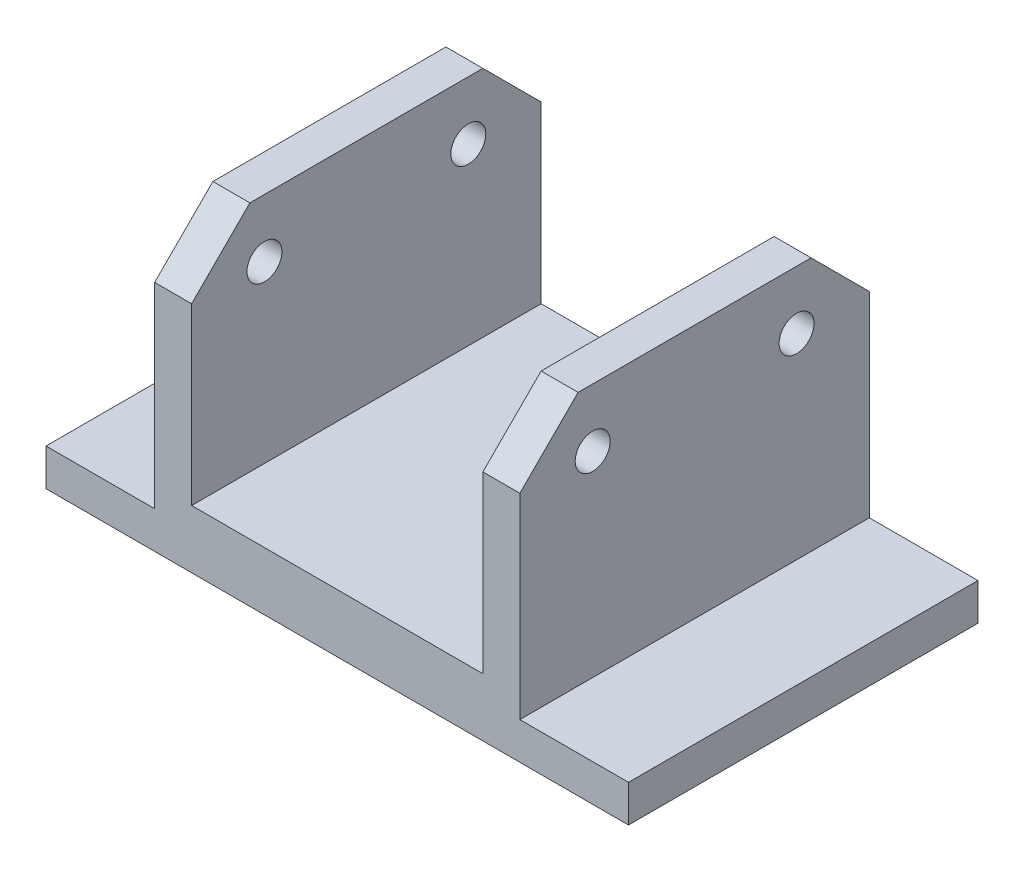
ISO-10303-21;
HEADER;
FILE_DESCRIPTION(('STEP AP214'),'2;1');
FILE_NAME('part.step','',(''),(''),'','','');
FILE_SCHEMA(('AUTOMOTIVE_DESIGN { 1 0 10303 214 1 1 1 1 }'));
ENDSEC;
DATA;
#1=APPLICATION_CONTEXT('core data for automotive mechanical design processes');
#2=APPLICATION_PROTOCOL_DEFINITION('international standard','automotive_design',2000,#1);
#3=PRODUCT_CONTEXT('',#1,'mechanical');
#4=PRODUCT('Part','Part','',(#3));
#5=PRODUCT_RELATED_PRODUCT_CATEGORY('part','',(#4));
#6=PRODUCT_DEFINITION_FORMATION('','',#4);
#7=PRODUCT_DEFINITION_CONTEXT('part definition',#1,'design');
#8=PRODUCT_DEFINITION('design','',#6,#7);
#9=PRODUCT_DEFINITION_SHAPE('','',#8);
#10=(LENGTH_UNIT() NAMED_UNIT(*) SI_UNIT(.MILLI.,.METRE.));
#11=(NAMED_UNIT(*) PLANE_ANGLE_UNIT() SI_UNIT($,.RADIAN.));
#12=(NAMED_UNIT(*) SI_UNIT($,.STERADIAN.) SOLID_ANGLE_UNIT());
#13=UNCERTAINTY_MEASURE_WITH_UNIT(LENGTH_MEASURE(1.E-05),#10,'distance_accuracy_value','');
#14=(GEOMETRIC_REPRESENTATION_CONTEXT(3) GLOBAL_UNCERTAINTY_ASSIGNED_CONTEXT((#13)) GLOBAL_UNIT_ASSIGNED_CONTEXT((#10,
#11,#12)) REPRESENTATION_CONTEXT('',''));
#15=CARTESIAN_POINT('',(0.,0.,0.));
#16=DIRECTION('',(0.,0.,1.));
#17=DIRECTION('',(1.,0.,0.));
#18=AXIS2_PLACEMENT_3D('',#15,#16,#17);
#19=CARTESIAN_POINT('',(100.,0.,60.));
#20=DIRECTION('',(-1.,0.,0.));
#21=DIRECTION('',(0.,0.,1.));
#22=AXIS2_PLACEMENT_3D('',#19,#20,#21);
#23=PLANE('',#22);
#24=DIRECTION('',(0.,1.,0.));
#25=VECTOR('',#24,1.);
#26=CARTESIAN_POINT('',(100.,0.,-60.));
#27=LINE('',#26,#25);
#28=CARTESIAN_POINT('',(100.,0.,-60.));
#29=VERTEX_POINT('',#28);
#30=CARTESIAN_POINT('',(100.,12.7,-60.));
#31=VERTEX_POINT('',#30);
#32=EDGE_CURVE('E172',#29,#31,#27,.T.);
#33=ORIENTED_EDGE('',*,*,#32,.T.);
#34=DIRECTION('',(0.,0.,-1.));
#35=VECTOR('',#34,1.);
#36=CARTESIAN_POINT('',(100.,12.7,60.));
#37=LINE('',#36,#35);
#38=CARTESIAN_POINT('',(100.,12.7,60.));
#39=VERTEX_POINT('',#38);
#40=EDGE_CURVE('E152',#39,#31,#37,.T.);
#41=ORIENTED_EDGE('',*,*,#40,.F.);
#42=DIRECTION('',(0.,1.,0.));
#43=VECTOR('',#42,1.);
#44=CARTESIAN_POINT('',(100.,0.,60.));
#45=LINE('',#44,#43);
#46=CARTESIAN_POINT('',(100.,0.,60.));
#47=VERTEX_POINT('',#46);
#48=EDGE_CURVE('E160',#47,#39,#45,.T.);
#49=ORIENTED_EDGE('',*,*,#48,.F.);
#50=DIRECTION('',(0.,0.,-1.));
#51=VECTOR('',#50,1.);
#52=CARTESIAN_POINT('',(100.,0.,60.));
#53=LINE('',#52,#51);
#54=EDGE_CURVE('E245',#47,#29,#53,.T.);
#55=ORIENTED_EDGE('',*,*,#54,.T.);
#56=EDGE_LOOP('',(#33,#41,#49,#55));
#57=FACE_BOUND('',#56,.T.);
#58=ADVANCED_FACE('F33',(#57),#23,.F.);
#59=CARTESIAN_POINT('',(100.,12.7,60.));
#60=DIRECTION('',(0.,-1.,0.));
#61=DIRECTION('',(1.,0.,0.));
#62=AXIS2_PLACEMENT_3D('',#59,#60,#61);
#63=PLANE('',#62);
#64=DIRECTION('',(-1.,0.,0.));
#65=VECTOR('',#64,1.);
#66=CARTESIAN_POINT('',(100.,12.7,-60.));
#67=LINE('',#66,#65);
#68=CARTESIAN_POINT('',(62.7,12.7,-60.));
#69=VERTEX_POINT('',#68);
#70=EDGE_CURVE('E247',#31,#69,#67,.T.);
#71=ORIENTED_EDGE('',*,*,#70,.T.);
#72=DIRECTION('',(0.,0.,-1.));
#73=VECTOR('',#72,1.);
#74=CARTESIAN_POINT('',(62.7,12.7,60.));
#75=LINE('',#74,#73);
#76=CARTESIAN_POINT('',(62.7,12.7,60.));
#77=VERTEX_POINT('',#76);
#78=EDGE_CURVE('E155',#77,#69,#75,.T.);
#79=ORIENTED_EDGE('',*,*,#78,.F.);
#80=DIRECTION('',(-1.,0.,0.));
#81=VECTOR('',#80,1.);
#82=CARTESIAN_POINT('',(100.,12.7,60.));
#83=LINE('',#82,#81);
#84=EDGE_CURVE('E148',#39,#77,#83,.T.);
#85=ORIENTED_EDGE('',*,*,#84,.F.);
#86=ORIENTED_EDGE('',*,*,#40,.T.);
#87=EDGE_LOOP('',(#71,#79,#85,#86));
#88=FACE_BOUND('',#87,.T.);
#89=ADVANCED_FACE('F150',(#88),#63,.F.);
#90=CARTESIAN_POINT('',(62.7,12.7,60.));
#91=DIRECTION('',(-1.,0.,0.));
#92=DIRECTION('',(0.,0.,1.));
#93=AXIS2_PLACEMENT_3D('',#90,#91,#92);
#94=PLANE('',#93);
#95=CARTESIAN_POINT('',(62.7,80.,-35.0000000000001));
#96=DIRECTION('',(1.,0.,0.));
#97=DIRECTION('',(0.,0.,1.));
#98=AXIS2_PLACEMENT_3D('',#95,#96,#97);
#99=CIRCLE('',#98,6.00000000000001);
#100=CARTESIAN_POINT('',(62.7,80.,-29.0000000000001));
#101=VERTEX_POINT('',#100);
#102=EDGE_CURVE('E404',#101,#101,#99,.T.);
#103=ORIENTED_EDGE('',*,*,#102,.F.);
#104=EDGE_LOOP('',(#103));
#105=FACE_BOUND('',#104,.T.);
#106=CARTESIAN_POINT('',(62.7,80.,35.));
#107=DIRECTION('',(1.,0.,0.));
#108=DIRECTION('',(0.,0.,-1.));
#109=AXIS2_PLACEMENT_3D('',#106,#107,#108);
#110=CIRCLE('',#109,6.);
#111=CARTESIAN_POINT('',(62.7,80.,29.));
#112=VERTEX_POINT('',#111);
#113=EDGE_CURVE('E212',#112,#112,#110,.T.);
#114=ORIENTED_EDGE('',*,*,#113,.F.);
#115=EDGE_LOOP('',(#114));
#116=FACE_BOUND('',#115,.T.);
#117=DIRECTION('',(0.,1.,0.));
#118=VECTOR('',#117,1.);
#119=CARTESIAN_POINT('',(62.7,12.7,-60.));
#120=LINE('',#119,#118);
#121=CARTESIAN_POINT('',(62.7,79.9999999999999,-60.));
#122=VERTEX_POINT('',#121);
#123=EDGE_CURVE('E249',#69,#122,#120,.T.);
#124=ORIENTED_EDGE('',*,*,#123,.T.);
#125=DIRECTION('',(0.,-0.707106781186549,-0.707106781186547));
#126=VECTOR('',#125,1.);
#127=CARTESIAN_POINT('',(62.7,100.,-40.));
#128=LINE('',#127,#126);
#129=CARTESIAN_POINT('',(62.7,100.,-40.));
#130=VERTEX_POINT('',#129);
#131=EDGE_CURVE('E193',#122,#130,#128,.F.);
#132=ORIENTED_EDGE('',*,*,#131,.T.);
#133=DIRECTION('',(0.,0.,-1.));
#134=VECTOR('',#133,1.);
#135=CARTESIAN_POINT('',(62.7,100.,60.));
#136=LINE('',#135,#134);
#137=CARTESIAN_POINT('',(62.7,100.,39.9999999999999));
#138=VERTEX_POINT('',#137);
#139=EDGE_CURVE('E177',#138,#130,#136,.T.);
#140=ORIENTED_EDGE('',*,*,#139,.F.);
#141=DIRECTION('',(0.,-0.707106781186546,0.707106781186549));
#142=VECTOR('',#141,1.);
#143=CARTESIAN_POINT('',(62.7,80.,60.));
#144=LINE('',#143,#142);
#145=CARTESIAN_POINT('',(62.7,80.,60.));
#146=VERTEX_POINT('',#145);
#147=EDGE_CURVE('E191',#138,#146,#144,.T.);
#148=ORIENTED_EDGE('',*,*,#147,.T.);
#149=DIRECTION('',(0.,1.,0.));
#150=VECTOR('',#149,1.);
#151=CARTESIAN_POINT('',(62.7,12.7,60.));
#152=LINE('',#151,#150);
#153=EDGE_CURVE('E159',#77,#146,#152,.T.);
#154=ORIENTED_EDGE('',*,*,#153,.F.);
#155=ORIENTED_EDGE('',*,*,#78,.T.);
#156=EDGE_LOOP('',(#124,#132,#140,#148,#154,#155));
#157=FACE_BOUND('',#156,.T.);
#158=ADVANCED_FACE('F342',(#105,#116,#157),#94,.F.);
#159=CARTESIAN_POINT('',(62.7,100.,60.));
#160=DIRECTION('',(0.,-1.,0.));
#161=DIRECTION('',(0.,0.,-1.));
#162=AXIS2_PLACEMENT_3D('',#159,#160,#161);
#163=PLANE('',#162);
#164=ORIENTED_EDGE('',*,*,#139,.T.);
#165=DIRECTION('',(-1.,0.,0.));
#166=VECTOR('',#165,1.);
#167=CARTESIAN_POINT('',(62.7,100.,-40.));
#168=LINE('',#167,#166);
#169=CARTESIAN_POINT('',(50.,100.,-40.));
#170=VERTEX_POINT('',#169);
#171=EDGE_CURVE('E175',#130,#170,#168,.T.);
#172=ORIENTED_EDGE('',*,*,#171,.T.);
#173=DIRECTION('',(0.,0.,-1.));
#174=VECTOR('',#173,1.);
#175=CARTESIAN_POINT('',(50.,100.,60.));
#176=LINE('',#175,#174);
#177=CARTESIAN_POINT('',(50.,100.,39.9999999999999));
#178=VERTEX_POINT('',#177);
#179=EDGE_CURVE('E286',#178,#170,#176,.T.);
#180=ORIENTED_EDGE('',*,*,#179,.F.);
#181=DIRECTION('',(1.,0.,0.));
#182=VECTOR('',#181,1.);
#183=CARTESIAN_POINT('',(62.7,100.,39.9999999999999));
#184=LINE('',#183,#182);
#185=EDGE_CURVE('E173',#178,#138,#184,.T.);
#186=ORIENTED_EDGE('',*,*,#185,.T.);
#187=EDGE_LOOP('',(#164,#172,#180,#186));
#188=FACE_BOUND('',#187,.T.);
#189=ADVANCED_FACE('F292',(#188),#163,.F.);
#190=CARTESIAN_POINT('',(50.,100.,60.));
#191=DIRECTION('',(1.,0.,0.));
#192=DIRECTION('',(0.,1.,0.));
#193=AXIS2_PLACEMENT_3D('',#190,#191,#192);
#194=PLANE('',#193);
#195=CARTESIAN_POINT('',(50.,80.,-35.0000000000001));
#196=DIRECTION('',(1.,0.,0.));
#197=DIRECTION('',(0.,1.,0.));
#198=AXIS2_PLACEMENT_3D('',#195,#196,#197);
#199=CIRCLE('',#198,6.00000000000001);
#200=CARTESIAN_POINT('',(50.,86.,-35.0000000000001));
#201=VERTEX_POINT('',#200);
#202=EDGE_CURVE('E219',#201,#201,#199,.T.);
#203=ORIENTED_EDGE('',*,*,#202,.T.);
#204=EDGE_LOOP('',(#203));
#205=FACE_BOUND('',#204,.T.);
#206=CARTESIAN_POINT('',(50.,80.,35.));
#207=DIRECTION('',(1.,0.,0.));
#208=DIRECTION('',(0.,1.,0.));
#209=AXIS2_PLACEMENT_3D('',#206,#207,#208);
#210=CIRCLE('',#209,6.);
#211=CARTESIAN_POINT('',(50.,86.,35.));
#212=VERTEX_POINT('',#211);
#213=EDGE_CURVE('E216',#212,#212,#210,.T.);
#214=ORIENTED_EDGE('',*,*,#213,.T.);
#215=EDGE_LOOP('',(#214));
#216=FACE_BOUND('',#215,.T.);
#217=ORIENTED_EDGE('',*,*,#179,.T.);
#218=DIRECTION('',(0.,0.707106781186549,0.707106781186547));
#219=VECTOR('',#218,1.);
#220=CARTESIAN_POINT('',(50.,100.,-40.));
#221=LINE('',#220,#219);
#222=CARTESIAN_POINT('',(50.,80.,-60.));
#223=VERTEX_POINT('',#222);
#224=EDGE_CURVE('E185',#170,#223,#221,.F.);
#225=ORIENTED_EDGE('',*,*,#224,.T.);
#226=DIRECTION('',(0.,-1.,0.));
#227=VECTOR('',#226,1.);
#228=CARTESIAN_POINT('',(50.,100.,-60.));
#229=LINE('',#228,#227);
#230=CARTESIAN_POINT('',(50.,20.,-60.));
#231=VERTEX_POINT('',#230);
#232=EDGE_CURVE('E252',#223,#231,#229,.T.);
#233=ORIENTED_EDGE('',*,*,#232,.T.);
#234=DIRECTION('',(0.,0.,-1.));
#235=VECTOR('',#234,1.);
#236=CARTESIAN_POINT('',(50.,20.,60.));
#237=LINE('',#236,#235);
#238=CARTESIAN_POINT('',(50.,20.,60.));
#239=VERTEX_POINT('',#238);
#240=EDGE_CURVE('E283',#239,#231,#237,.T.);
#241=ORIENTED_EDGE('',*,*,#240,.F.);
#242=DIRECTION('',(0.,-1.,0.));
#243=VECTOR('',#242,1.);
#244=CARTESIAN_POINT('',(50.,100.,60.));
#245=LINE('',#244,#243);
#246=CARTESIAN_POINT('',(50.,80.,60.));
#247=VERTEX_POINT('',#246);
#248=EDGE_CURVE('E231',#247,#239,#245,.T.);
#249=ORIENTED_EDGE('',*,*,#248,.F.);
#250=DIRECTION('',(0.,0.707106781186546,-0.707106781186549));
#251=VECTOR('',#250,1.);
#252=CARTESIAN_POINT('',(50.,80.,60.));
#253=LINE('',#252,#251);
#254=EDGE_CURVE('E183',#247,#178,#253,.T.);
#255=ORIENTED_EDGE('',*,*,#254,.T.);
#256=EDGE_LOOP('',(#217,#225,#233,#241,#249,#255));
#257=FACE_BOUND('',#256,.T.);
#258=ADVANCED_FACE('F303',(#205,#216,#257),#194,.F.);
#259=CARTESIAN_POINT('',(50.,20.,60.));
#260=DIRECTION('',(0.,-1.,0.));
#261=DIRECTION('',(0.,0.,-1.));
#262=AXIS2_PLACEMENT_3D('',#259,#260,#261);
#263=PLANE('',#262);
#264=DIRECTION('',(-1.,0.,0.));
#265=VECTOR('',#264,1.);
#266=CARTESIAN_POINT('',(50.,20.,-60.));
#267=LINE('',#266,#265);
#268=CARTESIAN_POINT('',(-50.,20.,-60.));
#269=VERTEX_POINT('',#268);
#270=EDGE_CURVE('E254',#231,#269,#267,.T.);
#271=ORIENTED_EDGE('',*,*,#270,.T.);
#272=DIRECTION('',(0.,0.,-1.));
#273=VECTOR('',#272,1.);
#274=CARTESIAN_POINT('',(-50.,20.,60.));
#275=LINE('',#274,#273);
#276=CARTESIAN_POINT('',(-50.,20.,60.));
#277=VERTEX_POINT('',#276);
#278=EDGE_CURVE('E280',#277,#269,#275,.T.);
#279=ORIENTED_EDGE('',*,*,#278,.F.);
#280=DIRECTION('',(-1.,0.,0.));
#281=VECTOR('',#280,1.);
#282=CARTESIAN_POINT('',(50.,20.,60.));
#283=LINE('',#282,#281);
#284=EDGE_CURVE('E233',#239,#277,#283,.T.);
#285=ORIENTED_EDGE('',*,*,#284,.F.);
#286=ORIENTED_EDGE('',*,*,#240,.T.);
#287=EDGE_LOOP('',(#271,#279,#285,#286));
#288=FACE_BOUND('',#287,.T.);
#289=ADVANCED_FACE('F312',(#288),#263,.F.);
#290=CARTESIAN_POINT('',(-50.,100.,60.));
#291=DIRECTION('',(-1.,0.,0.));
#292=DIRECTION('',(0.,-1.,0.));
#293=AXIS2_PLACEMENT_3D('',#290,#291,#292);
#294=PLANE('',#293);
#295=CARTESIAN_POINT('',(-50.,80.,-35.0000000000001));
#296=DIRECTION('',(-1.,0.,0.));
#297=DIRECTION('',(0.,-1.,0.));
#298=AXIS2_PLACEMENT_3D('',#295,#296,#297);
#299=CIRCLE('',#298,6.00000000000001);
#300=CARTESIAN_POINT('',(-50.,74.,-35.0000000000001));
#301=VERTEX_POINT('',#300);
#302=EDGE_CURVE('E224',#301,#301,#299,.T.);
#303=ORIENTED_EDGE('',*,*,#302,.T.);
#304=EDGE_LOOP('',(#303));
#305=FACE_BOUND('',#304,.T.);
#306=CARTESIAN_POINT('',(-50.,80.,35.));
#307=DIRECTION('',(-1.,0.,0.));
#308=DIRECTION('',(0.,-1.,0.));
#309=AXIS2_PLACEMENT_3D('',#306,#307,#308);
#310=CIRCLE('',#309,6.);
#311=CARTESIAN_POINT('',(-50.,74.,35.));
#312=VERTEX_POINT('',#311);
#313=EDGE_CURVE('E211',#312,#312,#310,.T.);
#314=ORIENTED_EDGE('',*,*,#313,.T.);
#315=EDGE_LOOP('',(#314));
#316=FACE_BOUND('',#315,.T.);
#317=DIRECTION('',(0.,1.,0.));
#318=VECTOR('',#317,1.);
#319=CARTESIAN_POINT('',(-50.,100.,-60.));
#320=LINE('',#319,#318);
#321=CARTESIAN_POINT('',(-50.,80.,-60.));
#322=VERTEX_POINT('',#321);
#323=EDGE_CURVE('E256',#269,#322,#320,.T.);
#324=ORIENTED_EDGE('',*,*,#323,.T.);
#325=DIRECTION('',(0.,-0.707106781186549,-0.707106781186547));
#326=VECTOR('',#325,1.);
#327=CARTESIAN_POINT('',(-50.,100.,-40.));
#328=LINE('',#327,#326);
#329=CARTESIAN_POINT('',(-50.,100.,-40.));
#330=VERTEX_POINT('',#329);
#331=EDGE_CURVE('E11',#322,#330,#328,.F.);
#332=ORIENTED_EDGE('',*,*,#331,.T.);
#333=DIRECTION('',(0.,0.,-1.));
#334=VECTOR('',#333,1.);
#335=CARTESIAN_POINT('',(-50.,100.,60.));
#336=LINE('',#335,#334);
#337=CARTESIAN_POINT('',(-50.,100.,39.9999999999999));
#338=VERTEX_POINT('',#337);
#339=EDGE_CURVE('E278',#338,#330,#336,.T.);
#340=ORIENTED_EDGE('',*,*,#339,.F.);
#341=DIRECTION('',(0.,-0.707106781186546,0.707106781186549));
#342=VECTOR('',#341,1.);
#343=CARTESIAN_POINT('',(-50.,80.,60.));
#344=LINE('',#343,#342);
#345=CARTESIAN_POINT('',(-50.,80.,60.));
#346=VERTEX_POINT('',#345);
#347=EDGE_CURVE('E42',#338,#346,#344,.T.);
#348=ORIENTED_EDGE('',*,*,#347,.T.);
#349=DIRECTION('',(0.,1.,0.));
#350=VECTOR('',#349,1.);
#351=CARTESIAN_POINT('',(-50.,100.,60.));
#352=LINE('',#351,#350);
#353=EDGE_CURVE('E235',#277,#346,#352,.T.);
#354=ORIENTED_EDGE('',*,*,#353,.F.);
#355=ORIENTED_EDGE('',*,*,#278,.T.);
#356=EDGE_LOOP('',(#324,#332,#340,#348,#354,#355));
#357=FACE_BOUND('',#356,.T.);
#358=ADVANCED_FACE('F315',(#305,#316,#357),#294,.F.);
#359=CARTESIAN_POINT('',(-62.7,100.,60.));
#360=DIRECTION('',(0.,-1.,0.));
#361=DIRECTION('',(0.,0.,-1.));
#362=AXIS2_PLACEMENT_3D('',#359,#360,#361);
#363=PLANE('',#362);
#364=ORIENTED_EDGE('',*,*,#339,.T.);
#365=DIRECTION('',(-1.,0.,0.));
#366=VECTOR('',#365,1.);
#367=CARTESIAN_POINT('',(-62.7,100.,-40.));
#368=LINE('',#367,#366);
#369=CARTESIAN_POINT('',(-62.7,100.,-40.));
#370=VERTEX_POINT('',#369);
#371=EDGE_CURVE('E202',#330,#370,#368,.T.);
#372=ORIENTED_EDGE('',*,*,#371,.T.);
#373=DIRECTION('',(0.,0.,-1.));
#374=VECTOR('',#373,1.);
#375=CARTESIAN_POINT('',(-62.7,100.,60.));
#376=LINE('',#375,#374);
#377=CARTESIAN_POINT('',(-62.7,100.,39.9999999999999));
#378=VERTEX_POINT('',#377);
#379=EDGE_CURVE('E275',#378,#370,#376,.T.);
#380=ORIENTED_EDGE('',*,*,#379,.F.);
#381=DIRECTION('',(1.,0.,0.));
#382=VECTOR('',#381,1.);
#383=CARTESIAN_POINT('',(-50.,100.,39.9999999999999));
#384=LINE('',#383,#382);
#385=EDGE_CURVE('E55',#378,#338,#384,.T.);
#386=ORIENTED_EDGE('',*,*,#385,.T.);
#387=EDGE_LOOP('',(#364,#372,#380,#386));
#388=FACE_BOUND('',#387,.T.);
#389=ADVANCED_FACE('F323',(#388),#363,.F.);
#390=CARTESIAN_POINT('',(-62.7,12.7,60.));
#391=DIRECTION('',(1.,0.,0.));
#392=DIRECTION('',(0.,0.,-1.));
#393=AXIS2_PLACEMENT_3D('',#390,#391,#392);
#394=PLANE('',#393);
#395=CARTESIAN_POINT('',(-62.7,80.,-35.0000000000001));
#396=DIRECTION('',(1.,0.,0.));
#397=DIRECTION('',(0.,0.,-1.));
#398=AXIS2_PLACEMENT_3D('',#395,#396,#397);
#399=CIRCLE('',#398,6.00000000000001);
#400=CARTESIAN_POINT('',(-62.7,80.,-41.0000000000001));
#401=VERTEX_POINT('',#400);
#402=EDGE_CURVE('E37',#401,#401,#399,.T.);
#403=ORIENTED_EDGE('',*,*,#402,.T.);
#404=EDGE_LOOP('',(#403));
#405=FACE_BOUND('',#404,.T.);
#406=CARTESIAN_POINT('',(-62.7,80.,35.));
#407=DIRECTION('',(1.,0.,0.));
#408=DIRECTION('',(0.,0.,-1.));
#409=AXIS2_PLACEMENT_3D('',#406,#407,#408);
#410=CIRCLE('',#409,6.);
#411=CARTESIAN_POINT('',(-62.7,80.,29.));
#412=VERTEX_POINT('',#411);
#413=EDGE_CURVE('E209',#412,#412,#410,.T.);
#414=ORIENTED_EDGE('',*,*,#413,.T.);
#415=EDGE_LOOP('',(#414));
#416=FACE_BOUND('',#415,.T.);
#417=ORIENTED_EDGE('',*,*,#379,.T.);
#418=DIRECTION('',(0.,0.707106781186549,0.707106781186547));
#419=VECTOR('',#418,1.);
#420=CARTESIAN_POINT('',(-62.7,100.,-40.));
#421=LINE('',#420,#419);
#422=CARTESIAN_POINT('',(-62.7,80.,-60.));
#423=VERTEX_POINT('',#422);
#424=EDGE_CURVE('E207',#370,#423,#421,.F.);
#425=ORIENTED_EDGE('',*,*,#424,.T.);
#426=DIRECTION('',(0.,-1.,0.));
#427=VECTOR('',#426,1.);
#428=CARTESIAN_POINT('',(-62.7,12.7,-60.));
#429=LINE('',#428,#427);
#430=CARTESIAN_POINT('',(-62.7,12.7,-60.));
#431=VERTEX_POINT('',#430);
#432=EDGE_CURVE('E258',#423,#431,#429,.T.);
#433=ORIENTED_EDGE('',*,*,#432,.T.);
#434=DIRECTION('',(0.,0.,-1.));
#435=VECTOR('',#434,1.);
#436=CARTESIAN_POINT('',(-62.7,12.7,60.));
#437=LINE('',#436,#435);
#438=CARTESIAN_POINT('',(-62.7,12.7,60.));
#439=VERTEX_POINT('',#438);
#440=EDGE_CURVE('E272',#439,#431,#437,.T.);
#441=ORIENTED_EDGE('',*,*,#440,.F.);
#442=DIRECTION('',(0.,-1.,0.));
#443=VECTOR('',#442,1.);
#444=CARTESIAN_POINT('',(-62.7,12.7,60.));
#445=LINE('',#444,#443);
#446=CARTESIAN_POINT('',(-62.7,80.,60.));
#447=VERTEX_POINT('',#446);
#448=EDGE_CURVE('E238',#447,#439,#445,.T.);
#449=ORIENTED_EDGE('',*,*,#448,.F.);
#450=DIRECTION('',(0.,0.707106781186546,-0.707106781186549));
#451=VECTOR('',#450,1.);
#452=CARTESIAN_POINT('',(-62.7,80.,60.));
#453=LINE('',#452,#451);
#454=EDGE_CURVE('E205',#447,#378,#453,.T.);
#455=ORIENTED_EDGE('',*,*,#454,.T.);
#456=EDGE_LOOP('',(#417,#425,#433,#441,#449,#455));
#457=FACE_BOUND('',#456,.T.);
#458=ADVANCED_FACE('F321',(#405,#416,#457),#394,.F.);
#459=CARTESIAN_POINT('',(-100.,12.7,60.));
#460=DIRECTION('',(0.,-1.,0.));
#461=DIRECTION('',(1.,0.,0.));
#462=AXIS2_PLACEMENT_3D('',#459,#460,#461);
#463=PLANE('',#462);
#464=DIRECTION('',(-1.,0.,0.));
#465=VECTOR('',#464,1.);
#466=CARTESIAN_POINT('',(-100.,12.7,-60.));
#467=LINE('',#466,#465);
#468=CARTESIAN_POINT('',(-100.,12.7,-60.));
#469=VERTEX_POINT('',#468);
#470=EDGE_CURVE('E260',#431,#469,#467,.T.);
#471=ORIENTED_EDGE('',*,*,#470,.T.);
#472=DIRECTION('',(0.,0.,-1.));
#473=VECTOR('',#472,1.);
#474=CARTESIAN_POINT('',(-100.,12.7,60.));
#475=LINE('',#474,#473);
#476=CARTESIAN_POINT('',(-100.,12.7,60.));
#477=VERTEX_POINT('',#476);
#478=EDGE_CURVE('E269',#477,#469,#475,.T.);
#479=ORIENTED_EDGE('',*,*,#478,.F.);
#480=DIRECTION('',(-1.,0.,0.));
#481=VECTOR('',#480,1.);
#482=CARTESIAN_POINT('',(-100.,12.7,60.));
#483=LINE('',#482,#481);
#484=EDGE_CURVE('E240',#439,#477,#483,.T.);
#485=ORIENTED_EDGE('',*,*,#484,.F.);
#486=ORIENTED_EDGE('',*,*,#440,.T.);
#487=EDGE_LOOP('',(#471,#479,#485,#486));
#488=FACE_BOUND('',#487,.T.);
#489=ADVANCED_FACE('F334',(#488),#463,.F.);
#490=CARTESIAN_POINT('',(-100.,0.,60.));
#491=DIRECTION('',(1.,0.,0.));
#492=DIRECTION('',(0.,0.,-1.));
#493=AXIS2_PLACEMENT_3D('',#490,#491,#492);
#494=PLANE('',#493);
#495=DIRECTION('',(0.,-1.,0.));
#496=VECTOR('',#495,1.);
#497=CARTESIAN_POINT('',(-100.,0.,-60.));
#498=LINE('',#497,#496);
#499=CARTESIAN_POINT('',(-100.,0.,-60.));
#500=VERTEX_POINT('',#499);
#501=EDGE_CURVE('E262',#469,#500,#498,.T.);
#502=ORIENTED_EDGE('',*,*,#501,.T.);
#503=DIRECTION('',(0.,0.,-1.));
#504=VECTOR('',#503,1.);
#505=CARTESIAN_POINT('',(-100.,0.,60.));
#506=LINE('',#505,#504);
#507=CARTESIAN_POINT('',(-100.,0.,60.));
#508=VERTEX_POINT('',#507);
#509=EDGE_CURVE('E266',#508,#500,#506,.T.);
#510=ORIENTED_EDGE('',*,*,#509,.F.);
#511=DIRECTION('',(0.,-1.,0.));
#512=VECTOR('',#511,1.);
#513=CARTESIAN_POINT('',(-100.,0.,60.));
#514=LINE('',#513,#512);
#515=EDGE_CURVE('E242',#477,#508,#514,.T.);
#516=ORIENTED_EDGE('',*,*,#515,.F.);
#517=ORIENTED_EDGE('',*,*,#478,.T.);
#518=EDGE_LOOP('',(#502,#510,#516,#517));
#519=FACE_BOUND('',#518,.T.);
#520=ADVANCED_FACE('F338',(#519),#494,.F.);
#521=CARTESIAN_POINT('',(-100.,0.,60.));
#522=DIRECTION('',(0.,1.,0.));
#523=DIRECTION('',(0.,0.,1.));
#524=AXIS2_PLACEMENT_3D('',#521,#522,#523);
#525=PLANE('',#524);
#526=DIRECTION('',(1.,0.,0.));
#527=VECTOR('',#526,1.);
#528=CARTESIAN_POINT('',(-100.,0.,-60.));
#529=LINE('',#528,#527);
#530=EDGE_CURVE('E169',#500,#29,#529,.T.);
#531=ORIENTED_EDGE('',*,*,#530,.T.);
#532=ORIENTED_EDGE('',*,*,#54,.F.);
#533=DIRECTION('',(1.,0.,0.));
#534=VECTOR('',#533,1.);
#535=CARTESIAN_POINT('',(-100.,0.,60.));
#536=LINE('',#535,#534);
#537=EDGE_CURVE('E165',#508,#47,#536,.T.);
#538=ORIENTED_EDGE('',*,*,#537,.F.);
#539=ORIENTED_EDGE('',*,*,#509,.T.);
#540=EDGE_LOOP('',(#531,#532,#538,#539));
#541=FACE_BOUND('',#540,.T.);
#542=ADVANCED_FACE('F341',(#541),#525,.F.);
#543=CARTESIAN_POINT('',(0.,0.,60.));
#544=DIRECTION('',(0.,0.,1.));
#545=DIRECTION('',(1.,0.,0.));
#546=AXIS2_PLACEMENT_3D('',#543,#544,#545);
#547=PLANE('',#546);
#548=ORIENTED_EDGE('',*,*,#153,.T.);
#549=DIRECTION('',(-1.,0.,0.));
#550=VECTOR('',#549,1.);
#551=CARTESIAN_POINT('',(50.,80.,60.));
#552=LINE('',#551,#550);
#553=EDGE_CURVE('E198',#146,#247,#552,.T.);
#554=ORIENTED_EDGE('',*,*,#553,.T.);
#555=ORIENTED_EDGE('',*,*,#248,.T.);
#556=ORIENTED_EDGE('',*,*,#284,.T.);
#557=ORIENTED_EDGE('',*,*,#353,.T.);
#558=DIRECTION('',(-1.,0.,0.));
#559=VECTOR('',#558,1.);
#560=CARTESIAN_POINT('',(-62.7,80.,60.));
#561=LINE('',#560,#559);
#562=EDGE_CURVE('E195',#346,#447,#561,.T.);
#563=ORIENTED_EDGE('',*,*,#562,.T.);
#564=ORIENTED_EDGE('',*,*,#448,.T.);
#565=ORIENTED_EDGE('',*,*,#484,.T.);
#566=ORIENTED_EDGE('',*,*,#515,.T.);
#567=ORIENTED_EDGE('',*,*,#537,.T.);
#568=ORIENTED_EDGE('',*,*,#48,.T.);
#569=ORIENTED_EDGE('',*,*,#84,.T.);
#570=EDGE_LOOP('',(#548,#554,#555,#556,#557,#563,#564,#565,#566,#567,#568,#569));
#571=FACE_BOUND('',#570,.T.);
#572=ADVANCED_FACE('F163',(#571),#547,.T.);
#573=CARTESIAN_POINT('',(0.,0.,-60.));
#574=DIRECTION('',(0.,0.,1.));
#575=DIRECTION('',(1.,0.,0.));
#576=AXIS2_PLACEMENT_3D('',#573,#574,#575);
#577=PLANE('',#576);
#578=ORIENTED_EDGE('',*,*,#232,.F.);
#579=DIRECTION('',(1.,0.,0.));
#580=VECTOR('',#579,1.);
#581=CARTESIAN_POINT('',(0.,80.,-60.));
#582=LINE('',#581,#580);
#583=EDGE_CURVE('E189',#223,#122,#582,.T.);
#584=ORIENTED_EDGE('',*,*,#583,.T.);
#585=ORIENTED_EDGE('',*,*,#123,.F.);
#586=ORIENTED_EDGE('',*,*,#70,.F.);
#587=ORIENTED_EDGE('',*,*,#32,.F.);
#588=ORIENTED_EDGE('',*,*,#530,.F.);
#589=ORIENTED_EDGE('',*,*,#501,.F.);
#590=ORIENTED_EDGE('',*,*,#470,.F.);
#591=ORIENTED_EDGE('',*,*,#432,.F.);
#592=DIRECTION('',(1.,0.,0.));
#593=VECTOR('',#592,1.);
#594=CARTESIAN_POINT('',(0.,80.,-60.));
#595=LINE('',#594,#593);
#596=EDGE_CURVE('E187',#423,#322,#595,.T.);
#597=ORIENTED_EDGE('',*,*,#596,.T.);
#598=ORIENTED_EDGE('',*,*,#323,.F.);
#599=ORIENTED_EDGE('',*,*,#270,.F.);
#600=EDGE_LOOP('',(#578,#584,#585,#586,#587,#588,#589,#590,#591,#597,#598,#599));
#601=FACE_BOUND('',#600,.T.);
#602=ADVANCED_FACE('F307',(#601),#577,.F.);
#603=CARTESIAN_POINT('',(62.7,100.,-40.));
#604=DIRECTION('',(0.,-0.707106781186546,0.707106781186548));
#605=DIRECTION('',(-1.,0.,0.));
#606=AXIS2_PLACEMENT_3D('',#603,#604,#605);
#607=PLANE('',#606);
#608=ORIENTED_EDGE('',*,*,#131,.F.);
#609=ORIENTED_EDGE('',*,*,#583,.F.);
#610=ORIENTED_EDGE('',*,*,#224,.F.);
#611=ORIENTED_EDGE('',*,*,#171,.F.);
#612=EDGE_LOOP('',(#608,#609,#610,#611));
#613=FACE_BOUND('',#612,.T.);
#614=ADVANCED_FACE('F299',(#613),#607,.F.);
#615=CARTESIAN_POINT('',(0.,80.,60.));
#616=DIRECTION('',(0.,0.707106781186549,0.707106781186546));
#617=DIRECTION('',(1.,0.,0.));
#618=AXIS2_PLACEMENT_3D('',#615,#616,#617);
#619=PLANE('',#618);
#620=ORIENTED_EDGE('',*,*,#147,.F.);
#621=ORIENTED_EDGE('',*,*,#185,.F.);
#622=ORIENTED_EDGE('',*,*,#254,.F.);
#623=ORIENTED_EDGE('',*,*,#553,.F.);
#624=EDGE_LOOP('',(#620,#621,#622,#623));
#625=FACE_BOUND('',#624,.T.);
#626=ADVANCED_FACE('F346',(#625),#619,.T.);
#627=CARTESIAN_POINT('',(-62.7,100.,-40.));
#628=DIRECTION('',(0.,-0.707106781186546,0.707106781186548));
#629=DIRECTION('',(-1.,0.,0.));
#630=AXIS2_PLACEMENT_3D('',#627,#628,#629);
#631=PLANE('',#630);
#632=ORIENTED_EDGE('',*,*,#331,.F.);
#633=ORIENTED_EDGE('',*,*,#596,.F.);
#634=ORIENTED_EDGE('',*,*,#424,.F.);
#635=ORIENTED_EDGE('',*,*,#371,.F.);
#636=EDGE_LOOP('',(#632,#633,#634,#635));
#637=FACE_BOUND('',#636,.T.);
#638=ADVANCED_FACE('F326',(#637),#631,.F.);
#639=CARTESIAN_POINT('',(0.,80.,60.));
#640=DIRECTION('',(0.,0.707106781186549,0.707106781186546));
#641=DIRECTION('',(1.,0.,0.));
#642=AXIS2_PLACEMENT_3D('',#639,#640,#641);
#643=PLANE('',#642);
#644=ORIENTED_EDGE('',*,*,#347,.F.);
#645=ORIENTED_EDGE('',*,*,#385,.F.);
#646=ORIENTED_EDGE('',*,*,#454,.F.);
#647=ORIENTED_EDGE('',*,*,#562,.F.);
#648=EDGE_LOOP('',(#644,#645,#646,#647));
#649=FACE_BOUND('',#648,.T.);
#650=ADVANCED_FACE('F35',(#649),#643,.T.);
#651=CARTESIAN_POINT('',(-100.,80.,35.));
#652=DIRECTION('',(1.,0.,0.));
#653=DIRECTION('',(0.,0.,-1.));
#654=AXIS2_PLACEMENT_3D('',#651,#652,#653);
#655=CYLINDRICAL_SURFACE('',#654,6.);
#656=ORIENTED_EDGE('',*,*,#413,.F.);
#657=EDGE_LOOP('',(#656));
#658=FACE_BOUND('',#657,.T.);
#659=ORIENTED_EDGE('',*,*,#313,.F.);
#660=EDGE_LOOP('',(#659));
#661=FACE_BOUND('',#660,.T.);
#662=ADVANCED_FACE('F393',(#658,#661),#655,.F.);
#663=ORIENTED_EDGE('',*,*,#113,.T.);
#664=EDGE_LOOP('',(#663));
#665=FACE_BOUND('',#664,.T.);
#666=ORIENTED_EDGE('',*,*,#213,.F.);
#667=EDGE_LOOP('',(#666));
#668=FACE_BOUND('',#667,.T.);
#669=ADVANCED_FACE('F389',(#665,#668),#655,.F.);
#670=CARTESIAN_POINT('',(-100.,80.,-35.0000000000001));
#671=DIRECTION('',(1.,0.,0.));
#672=DIRECTION('',(0.,0.,-1.));
#673=AXIS2_PLACEMENT_3D('',#670,#671,#672);
#674=CYLINDRICAL_SURFACE('',#673,6.00000000000001);
#675=ORIENTED_EDGE('',*,*,#402,.F.);
#676=EDGE_LOOP('',(#675));
#677=FACE_BOUND('',#676,.T.);
#678=ORIENTED_EDGE('',*,*,#302,.F.);
#679=EDGE_LOOP('',(#678));
#680=FACE_BOUND('',#679,.T.);
#681=ADVANCED_FACE('F392',(#677,#680),#674,.F.);
#682=ORIENTED_EDGE('',*,*,#102,.T.);
#683=EDGE_LOOP('',(#682));
#684=FACE_BOUND('',#683,.T.);
#685=ORIENTED_EDGE('',*,*,#202,.F.);
#686=EDGE_LOOP('',(#685));
#687=FACE_BOUND('',#686,.T.);
#688=ADVANCED_FACE('F394',(#684,#687),#674,.F.);
#689=CLOSED_SHELL('',(#58,#89,#158,#189,#258,#289,#358,#389,#458,#489,#520,#542,#572,#602,#614,
#626,#638,#650,#662,#669,#681,#688));
#690=MANIFOLD_SOLID_BREP('B2',#689);
#691=ADVANCED_BREP_SHAPE_REPRESENTATION('',(#18,#690),#14);
#692=SHAPE_DEFINITION_REPRESENTATION(#9,#691);
ENDSEC;
END-ISO-10303-21;
